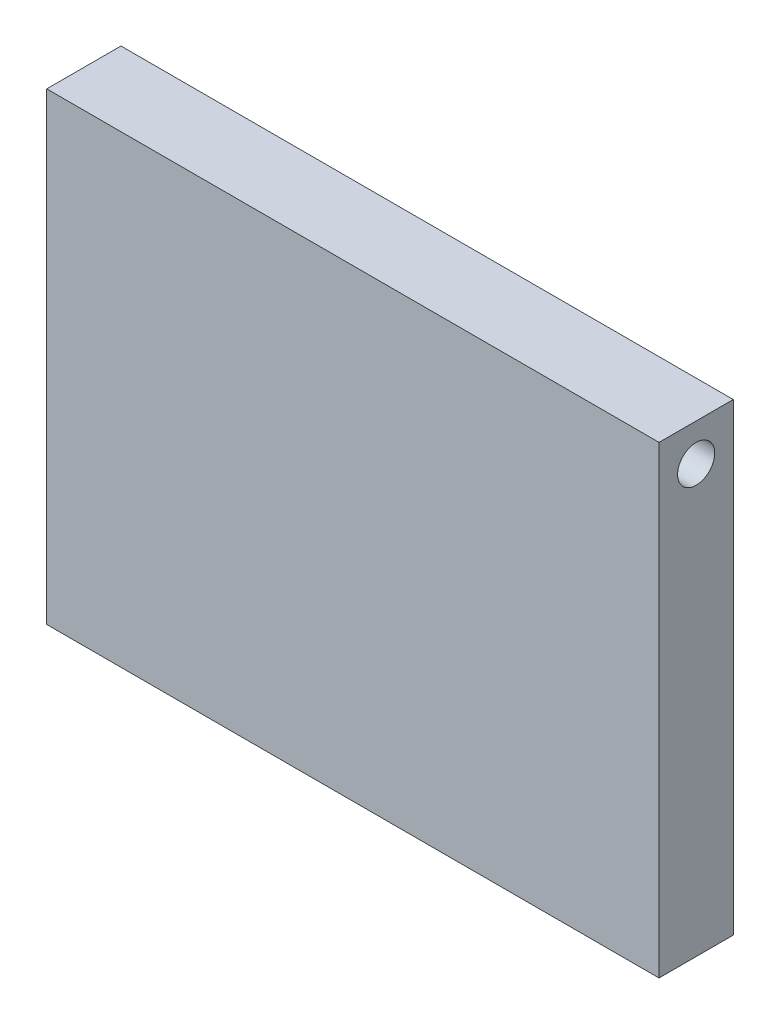
ISO-10303-21;
HEADER;
FILE_DESCRIPTION(('STEP AP214'),'2;1');
FILE_NAME('part.step','',(''),(''),'','','');
FILE_SCHEMA(('AUTOMOTIVE_DESIGN { 1 0 10303 214 1 1 1 1 }'));
ENDSEC;
DATA;
#1=APPLICATION_CONTEXT('core data for automotive mechanical design processes');
#2=APPLICATION_PROTOCOL_DEFINITION('international standard','automotive_design',2000,#1);
#3=PRODUCT_CONTEXT('',#1,'mechanical');
#4=PRODUCT('Part','Part','',(#3));
#5=PRODUCT_RELATED_PRODUCT_CATEGORY('part','',(#4));
#6=PRODUCT_DEFINITION_FORMATION('','',#4);
#7=PRODUCT_DEFINITION_CONTEXT('part definition',#1,'design');
#8=PRODUCT_DEFINITION('design','',#6,#7);
#9=PRODUCT_DEFINITION_SHAPE('','',#8);
#10=(LENGTH_UNIT() NAMED_UNIT(*) SI_UNIT(.MILLI.,.METRE.));
#11=(NAMED_UNIT(*) PLANE_ANGLE_UNIT() SI_UNIT($,.RADIAN.));
#12=(NAMED_UNIT(*) SI_UNIT($,.STERADIAN.) SOLID_ANGLE_UNIT());
#13=UNCERTAINTY_MEASURE_WITH_UNIT(LENGTH_MEASURE(1.E-05),#10,'distance_accuracy_value','');
#14=(GEOMETRIC_REPRESENTATION_CONTEXT(3) GLOBAL_UNCERTAINTY_ASSIGNED_CONTEXT((#13)) GLOBAL_UNIT_ASSIGNED_CONTEXT((#10,
#11,#12)) REPRESENTATION_CONTEXT('',''));
#15=CARTESIAN_POINT('',(0.,0.,0.));
#16=DIRECTION('',(0.,0.,1.));
#17=DIRECTION('',(1.,0.,0.));
#18=AXIS2_PLACEMENT_3D('',#15,#16,#17);
#19=CARTESIAN_POINT('',(-16.2138728323699,25.,-2.8135838150289));
#20=DIRECTION('',(1.,0.,0.));
#21=DIRECTION('',(0.,0.,-1.));
#22=AXIS2_PLACEMENT_3D('',#19,#20,#21);
#23=PLANE('',#22);
#24=CARTESIAN_POINT('',(-16.2138728323699,23.,-0.8135838150289));
#25=DIRECTION('',(1.,0.,0.));
#26=DIRECTION('',(0.,0.,-1.));
#27=AXIS2_PLACEMENT_3D('',#24,#25,#26);
#28=CIRCLE('',#27,1.);
#29=CARTESIAN_POINT('',(-16.2138728323699,23.,-1.8135838150289));
#30=VERTEX_POINT('',#29);
#31=EDGE_CURVE('E115',#30,#30,#28,.T.);
#32=ORIENTED_EDGE('',*,*,#31,.T.);
#33=EDGE_LOOP('',(#32));
#34=FACE_BOUND('',#33,.T.);
#35=DIRECTION('',(0.,0.,1.));
#36=VECTOR('',#35,1.);
#37=CARTESIAN_POINT('',(-16.2138728323699,0.,-2.8135838150289));
#38=LINE('',#37,#36);
#39=CARTESIAN_POINT('',(-16.2138728323699,0.,-2.8135838150289));
#40=VERTEX_POINT('',#39);
#41=CARTESIAN_POINT('',(-16.2138728323699,0.,1.1864161849711));
#42=VERTEX_POINT('',#41);
#43=EDGE_CURVE('E111',#40,#42,#38,.T.);
#44=ORIENTED_EDGE('',*,*,#43,.T.);
#45=DIRECTION('',(0.,-1.,0.));
#46=VECTOR('',#45,1.);
#47=CARTESIAN_POINT('',(-16.2138728323699,25.,1.1864161849711));
#48=LINE('',#47,#46);
#49=CARTESIAN_POINT('',(-16.2138728323699,25.,1.1864161849711));
#50=VERTEX_POINT('',#49);
#51=EDGE_CURVE('E11',#50,#42,#48,.T.);
#52=ORIENTED_EDGE('',*,*,#51,.F.);
#53=DIRECTION('',(0.,0.,1.));
#54=VECTOR('',#53,1.);
#55=CARTESIAN_POINT('',(-16.2138728323699,25.,-2.8135838150289));
#56=LINE('',#55,#54);
#57=CARTESIAN_POINT('',(-16.2138728323699,25.,-2.8135838150289));
#58=VERTEX_POINT('',#57);
#59=EDGE_CURVE('E95',#58,#50,#56,.T.);
#60=ORIENTED_EDGE('',*,*,#59,.F.);
#61=DIRECTION('',(0.,-1.,0.));
#62=VECTOR('',#61,1.);
#63=CARTESIAN_POINT('',(-16.2138728323699,25.,-2.8135838150289));
#64=LINE('',#63,#62);
#65=EDGE_CURVE('E107',#58,#40,#64,.T.);
#66=ORIENTED_EDGE('',*,*,#65,.T.);
#67=EDGE_LOOP('',(#44,#52,#60,#66));
#68=FACE_BOUND('',#67,.T.);
#69=ADVANCED_FACE('F43',(#34,#68),#23,.F.);
#70=CARTESIAN_POINT('',(-16.2138728323699,25.,1.1864161849711));
#71=DIRECTION('',(0.,0.,-1.));
#72=DIRECTION('',(-1.,0.,0.));
#73=AXIS2_PLACEMENT_3D('',#70,#71,#72);
#74=PLANE('',#73);
#75=DIRECTION('',(1.,0.,0.));
#76=VECTOR('',#75,1.);
#77=CARTESIAN_POINT('',(-16.2138728323699,0.,1.1864161849711));
#78=LINE('',#77,#76);
#79=CARTESIAN_POINT('',(16.7861271676301,0.,1.1864161849711));
#80=VERTEX_POINT('',#79);
#81=EDGE_CURVE('E100',#42,#80,#78,.T.);
#82=ORIENTED_EDGE('',*,*,#81,.T.);
#83=DIRECTION('',(0.,-1.,0.));
#84=VECTOR('',#83,1.);
#85=CARTESIAN_POINT('',(16.7861271676301,25.,1.1864161849711));
#86=LINE('',#85,#84);
#87=CARTESIAN_POINT('',(16.7861271676301,25.,1.1864161849711));
#88=VERTEX_POINT('',#87);
#89=EDGE_CURVE('E52',#88,#80,#86,.T.);
#90=ORIENTED_EDGE('',*,*,#89,.F.);
#91=DIRECTION('',(1.,0.,0.));
#92=VECTOR('',#91,1.);
#93=CARTESIAN_POINT('',(-16.2138728323699,25.,1.1864161849711));
#94=LINE('',#93,#92);
#95=EDGE_CURVE('E90',#50,#88,#94,.T.);
#96=ORIENTED_EDGE('',*,*,#95,.F.);
#97=ORIENTED_EDGE('',*,*,#51,.T.);
#98=EDGE_LOOP('',(#82,#90,#96,#97));
#99=FACE_BOUND('',#98,.T.);
#100=ADVANCED_FACE('F99',(#99),#74,.F.);
#101=CARTESIAN_POINT('',(16.7861271676301,25.,-2.8135838150289));
#102=DIRECTION('',(-1.,0.,0.));
#103=DIRECTION('',(0.,0.,1.));
#104=AXIS2_PLACEMENT_3D('',#101,#102,#103);
#105=PLANE('',#104);
#106=CARTESIAN_POINT('',(16.7861271676301,23.,-0.8135838150289));
#107=DIRECTION('',(1.,0.,0.));
#108=DIRECTION('',(0.,0.,-1.));
#109=AXIS2_PLACEMENT_3D('',#106,#107,#108);
#110=CIRCLE('',#109,1.);
#111=CARTESIAN_POINT('',(16.7861271676301,23.,-1.8135838150289));
#112=VERTEX_POINT('',#111);
#113=EDGE_CURVE('E132',#112,#112,#110,.T.);
#114=ORIENTED_EDGE('',*,*,#113,.F.);
#115=EDGE_LOOP('',(#114));
#116=FACE_BOUND('',#115,.T.);
#117=DIRECTION('',(0.,0.,-1.));
#118=VECTOR('',#117,1.);
#119=CARTESIAN_POINT('',(16.7861271676301,0.,-2.8135838150289));
#120=LINE('',#119,#118);
#121=CARTESIAN_POINT('',(16.7861271676301,0.,-2.8135838150289));
#122=VERTEX_POINT('',#121);
#123=EDGE_CURVE('E77',#80,#122,#120,.T.);
#124=ORIENTED_EDGE('',*,*,#123,.T.);
#125=DIRECTION('',(0.,-1.,0.));
#126=VECTOR('',#125,1.);
#127=CARTESIAN_POINT('',(16.7861271676301,25.,-2.8135838150289));
#128=LINE('',#127,#126);
#129=CARTESIAN_POINT('',(16.7861271676301,25.,-2.8135838150289));
#130=VERTEX_POINT('',#129);
#131=EDGE_CURVE('E102',#130,#122,#128,.T.);
#132=ORIENTED_EDGE('',*,*,#131,.F.);
#133=DIRECTION('',(0.,0.,-1.));
#134=VECTOR('',#133,1.);
#135=CARTESIAN_POINT('',(16.7861271676301,25.,-2.8135838150289));
#136=LINE('',#135,#134);
#137=EDGE_CURVE('E93',#88,#130,#136,.T.);
#138=ORIENTED_EDGE('',*,*,#137,.F.);
#139=ORIENTED_EDGE('',*,*,#89,.T.);
#140=EDGE_LOOP('',(#124,#132,#138,#139));
#141=FACE_BOUND('',#140,.T.);
#142=ADVANCED_FACE('F103',(#116,#141),#105,.F.);
#143=CARTESIAN_POINT('',(-16.2138728323699,25.,-2.8135838150289));
#144=DIRECTION('',(0.,0.,1.));
#145=DIRECTION('',(1.,0.,0.));
#146=AXIS2_PLACEMENT_3D('',#143,#144,#145);
#147=PLANE('',#146);
#148=DIRECTION('',(-1.,0.,0.));
#149=VECTOR('',#148,1.);
#150=CARTESIAN_POINT('',(-16.2138728323699,0.,-2.8135838150289));
#151=LINE('',#150,#149);
#152=EDGE_CURVE('E83',#122,#40,#151,.T.);
#153=ORIENTED_EDGE('',*,*,#152,.T.);
#154=ORIENTED_EDGE('',*,*,#65,.F.);
#155=DIRECTION('',(-1.,0.,0.));
#156=VECTOR('',#155,1.);
#157=CARTESIAN_POINT('',(-16.2138728323699,25.,-2.8135838150289));
#158=LINE('',#157,#156);
#159=EDGE_CURVE('E60',#130,#58,#158,.T.);
#160=ORIENTED_EDGE('',*,*,#159,.F.);
#161=ORIENTED_EDGE('',*,*,#131,.T.);
#162=EDGE_LOOP('',(#153,#154,#160,#161));
#163=FACE_BOUND('',#162,.T.);
#164=ADVANCED_FACE('F125',(#163),#147,.F.);
#165=CARTESIAN_POINT('',(0.,25.,0.));
#166=DIRECTION('',(0.,1.,0.));
#167=DIRECTION('',(0.,0.,1.));
#168=AXIS2_PLACEMENT_3D('',#165,#166,#167);
#169=PLANE('',#168);
#170=ORIENTED_EDGE('',*,*,#59,.T.);
#171=ORIENTED_EDGE('',*,*,#95,.T.);
#172=ORIENTED_EDGE('',*,*,#137,.T.);
#173=ORIENTED_EDGE('',*,*,#159,.T.);
#174=EDGE_LOOP('',(#170,#171,#172,#173));
#175=FACE_BOUND('',#174,.T.);
#176=ADVANCED_FACE('F91',(#175),#169,.T.);
#177=CARTESIAN_POINT('',(0.,0.,0.));
#178=DIRECTION('',(0.,1.,0.));
#179=DIRECTION('',(0.,0.,1.));
#180=AXIS2_PLACEMENT_3D('',#177,#178,#179);
#181=PLANE('',#180);
#182=ORIENTED_EDGE('',*,*,#43,.F.);
#183=ORIENTED_EDGE('',*,*,#152,.F.);
#184=ORIENTED_EDGE('',*,*,#123,.F.);
#185=ORIENTED_EDGE('',*,*,#81,.F.);
#186=EDGE_LOOP('',(#182,#183,#184,#185));
#187=FACE_BOUND('',#186,.T.);
#188=ADVANCED_FACE('F128',(#187),#181,.F.);
#189=CARTESIAN_POINT('',(-16.2138728323699,23.,-0.8135838150289));
#190=DIRECTION('',(1.,0.,0.));
#191=DIRECTION('',(0.,0.,-1.));
#192=AXIS2_PLACEMENT_3D('',#189,#190,#191);
#193=CYLINDRICAL_SURFACE('',#192,1.);
#194=ORIENTED_EDGE('',*,*,#31,.F.);
#195=EDGE_LOOP('',(#194));
#196=FACE_BOUND('',#195,.T.);
#197=ORIENTED_EDGE('',*,*,#113,.T.);
#198=EDGE_LOOP('',(#197));
#199=FACE_BOUND('',#198,.T.);
#200=ADVANCED_FACE('F141',(#196,#199),#193,.F.);
#201=CLOSED_SHELL('',(#69,#100,#142,#164,#176,#188,#200));
#202=MANIFOLD_SOLID_BREP('B2',#201);
#203=ADVANCED_BREP_SHAPE_REPRESENTATION('',(#18,#202),#14);
#204=SHAPE_DEFINITION_REPRESENTATION(#9,#203);
ENDSEC;
END-ISO-10303-21;
